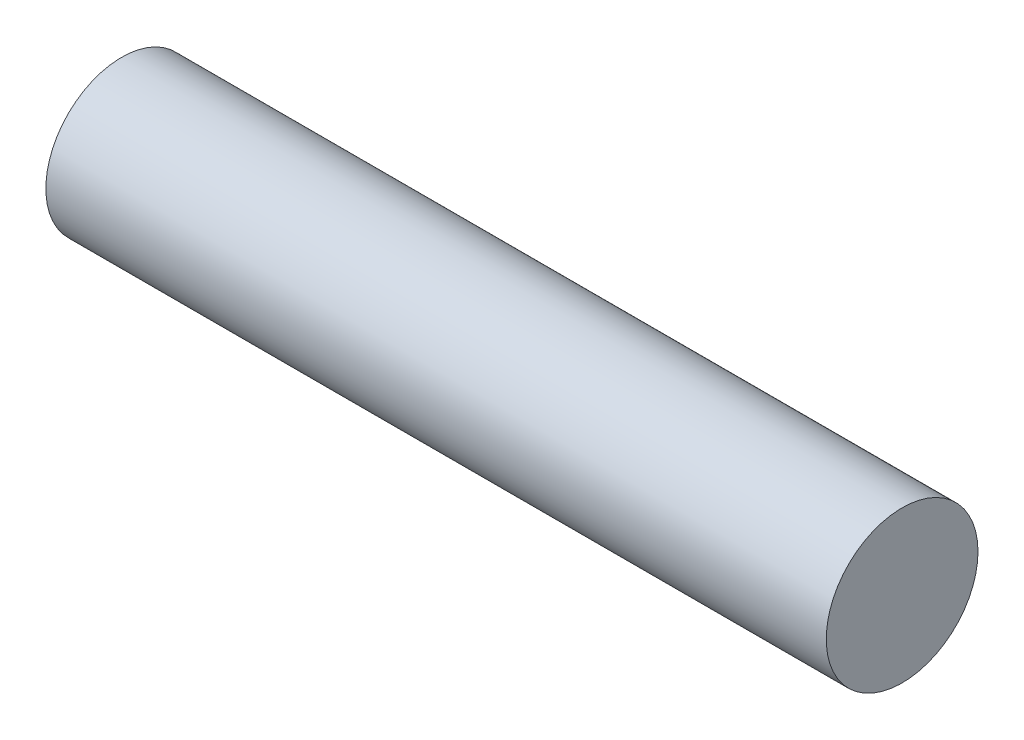
ISO-10303-21;
HEADER;
FILE_DESCRIPTION(('STEP AP214'),'2;1');
FILE_NAME('part.step','',(''),(''),'','','');
FILE_SCHEMA(('AUTOMOTIVE_DESIGN { 1 0 10303 214 1 1 1 1 }'));
ENDSEC;
DATA;
#1=APPLICATION_CONTEXT('core data for automotive mechanical design processes');
#2=APPLICATION_PROTOCOL_DEFINITION('international standard','automotive_design',2000,#1);
#3=PRODUCT_CONTEXT('',#1,'mechanical');
#4=PRODUCT('Part','Part','',(#3));
#5=PRODUCT_RELATED_PRODUCT_CATEGORY('part','',(#4));
#6=PRODUCT_DEFINITION_FORMATION('','',#4);
#7=PRODUCT_DEFINITION_CONTEXT('part definition',#1,'design');
#8=PRODUCT_DEFINITION('design','',#6,#7);
#9=PRODUCT_DEFINITION_SHAPE('','',#8);
#10=(LENGTH_UNIT() NAMED_UNIT(*) SI_UNIT(.MILLI.,.METRE.));
#11=(NAMED_UNIT(*) PLANE_ANGLE_UNIT() SI_UNIT($,.RADIAN.));
#12=(NAMED_UNIT(*) SI_UNIT($,.STERADIAN.) SOLID_ANGLE_UNIT());
#13=UNCERTAINTY_MEASURE_WITH_UNIT(LENGTH_MEASURE(1.E-05),#10,'distance_accuracy_value','');
#14=(GEOMETRIC_REPRESENTATION_CONTEXT(3) GLOBAL_UNCERTAINTY_ASSIGNED_CONTEXT((#13)) GLOBAL_UNIT_ASSIGNED_CONTEXT((#10,
#11,#12)) REPRESENTATION_CONTEXT('',''));
#15=CARTESIAN_POINT('',(0.,0.,0.));
#16=DIRECTION('',(0.,0.,1.));
#17=DIRECTION('',(1.,0.,0.));
#18=AXIS2_PLACEMENT_3D('',#15,#16,#17);
#19=CARTESIAN_POINT('',(9.,0.,0.));
#20=DIRECTION('',(-1.,0.,0.));
#21=DIRECTION('',(0.,0.,1.));
#22=AXIS2_PLACEMENT_3D('',#19,#20,#21);
#23=CYLINDRICAL_SURFACE('',#22,0.875);
#24=CARTESIAN_POINT('',(9.,0.,0.));
#25=DIRECTION('',(1.,0.,0.));
#26=DIRECTION('',(0.,0.,-1.));
#27=AXIS2_PLACEMENT_3D('',#24,#25,#26);
#28=CIRCLE('',#27,0.875);
#29=CARTESIAN_POINT('',(9.,0.,-0.875));
#30=VERTEX_POINT('',#29);
#31=EDGE_CURVE('E10',#30,#30,#28,.T.);
#32=ORIENTED_EDGE('',*,*,#31,.F.);
#33=EDGE_LOOP('',(#32));
#34=FACE_BOUND('',#33,.T.);
#35=CARTESIAN_POINT('',(0.,0.,0.));
#36=DIRECTION('',(1.,0.,0.));
#37=DIRECTION('',(0.,0.,-1.));
#38=AXIS2_PLACEMENT_3D('',#35,#36,#37);
#39=CIRCLE('',#38,0.875);
#40=CARTESIAN_POINT('',(0.,0.,-0.875));
#41=VERTEX_POINT('',#40);
#42=EDGE_CURVE('E36',#41,#41,#39,.T.);
#43=ORIENTED_EDGE('',*,*,#42,.T.);
#44=EDGE_LOOP('',(#43));
#45=FACE_BOUND('',#44,.T.);
#46=ADVANCED_FACE('F33',(#34,#45),#23,.T.);
#47=CARTESIAN_POINT('',(9.,0.,0.));
#48=DIRECTION('',(1.,0.,0.));
#49=DIRECTION('',(0.,0.,-1.));
#50=AXIS2_PLACEMENT_3D('',#47,#48,#49);
#51=PLANE('',#50);
#52=ORIENTED_EDGE('',*,*,#31,.T.);
#53=EDGE_LOOP('',(#52));
#54=FACE_BOUND('',#53,.T.);
#55=ADVANCED_FACE('F48',(#54),#51,.T.);
#56=CARTESIAN_POINT('',(0.,0.,0.));
#57=DIRECTION('',(1.,0.,0.));
#58=DIRECTION('',(0.,0.,-1.));
#59=AXIS2_PLACEMENT_3D('',#56,#57,#58);
#60=PLANE('',#59);
#61=ORIENTED_EDGE('',*,*,#42,.F.);
#62=EDGE_LOOP('',(#61));
#63=FACE_BOUND('',#62,.T.);
#64=ADVANCED_FACE('F46',(#63),#60,.F.);
#65=CLOSED_SHELL('',(#46,#55,#64));
#66=MANIFOLD_SOLID_BREP('B2',#65);
#67=ADVANCED_BREP_SHAPE_REPRESENTATION('',(#18,#66),#14);
#68=SHAPE_DEFINITION_REPRESENTATION(#9,#67);
ENDSEC;
END-ISO-10303-21;
